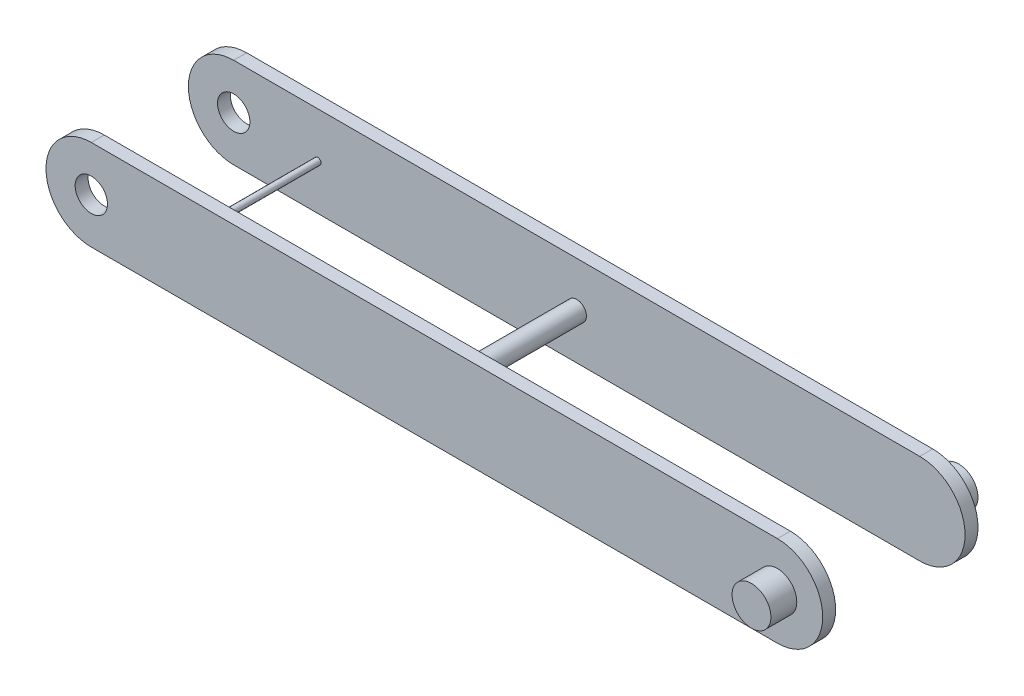
ISO-10303-21;
HEADER;
FILE_DESCRIPTION(('STEP AP214'),'2;1');
FILE_NAME('part.step','',(''),(''),'','','');
FILE_SCHEMA(('AUTOMOTIVE_DESIGN { 1 0 10303 214 1 1 1 1 }'));
ENDSEC;
DATA;
#1=APPLICATION_CONTEXT('core data for automotive mechanical design processes');
#2=APPLICATION_PROTOCOL_DEFINITION('international standard','automotive_design',2000,#1);
#3=PRODUCT_CONTEXT('',#1,'mechanical');
#4=PRODUCT('Part','Part','',(#3));
#5=PRODUCT_RELATED_PRODUCT_CATEGORY('part','',(#4));
#6=PRODUCT_DEFINITION_FORMATION('','',#4);
#7=PRODUCT_DEFINITION_CONTEXT('part definition',#1,'design');
#8=PRODUCT_DEFINITION('design','',#6,#7);
#9=PRODUCT_DEFINITION_SHAPE('','',#8);
#10=(LENGTH_UNIT() NAMED_UNIT(*) SI_UNIT(.MILLI.,.METRE.));
#11=(NAMED_UNIT(*) PLANE_ANGLE_UNIT() SI_UNIT($,.RADIAN.));
#12=(NAMED_UNIT(*) SI_UNIT($,.STERADIAN.) SOLID_ANGLE_UNIT());
#13=UNCERTAINTY_MEASURE_WITH_UNIT(LENGTH_MEASURE(1.E-05),#10,'distance_accuracy_value','');
#14=(GEOMETRIC_REPRESENTATION_CONTEXT(3) GLOBAL_UNCERTAINTY_ASSIGNED_CONTEXT((#13)) GLOBAL_UNIT_ASSIGNED_CONTEXT((#10,
#11,#12)) REPRESENTATION_CONTEXT('',''));
#15=CARTESIAN_POINT('',(0.,0.,0.));
#16=DIRECTION('',(0.,0.,1.));
#17=DIRECTION('',(1.,0.,0.));
#18=AXIS2_PLACEMENT_3D('',#15,#16,#17);
#19=CARTESIAN_POINT('',(-265.,0.,10.));
#20=DIRECTION('',(0.,0.,-1.));
#21=DIRECTION('',(-1.,0.,0.));
#22=AXIS2_PLACEMENT_3D('',#19,#20,#21);
#23=CYLINDRICAL_SURFACE('',#22,35.0000000000001);
#24=CARTESIAN_POINT('',(-265.,0.,0.));
#25=DIRECTION('',(0.,0.,1.));
#26=DIRECTION('',(1.,0.,0.));
#27=AXIS2_PLACEMENT_3D('',#24,#25,#26);
#28=CIRCLE('',#27,35.0000000000001);
#29=CARTESIAN_POINT('',(-265.,35.0000000000001,0.));
#30=VERTEX_POINT('',#29);
#31=CARTESIAN_POINT('',(-265.,-35.0000000000001,0.));
#32=VERTEX_POINT('',#31);
#33=EDGE_CURVE('E163',#30,#32,#28,.T.);
#34=ORIENTED_EDGE('',*,*,#33,.T.);
#35=DIRECTION('',(0.,0.,-1.));
#36=VECTOR('',#35,1.);
#37=CARTESIAN_POINT('',(-265.,-35.0000000000001,10.));
#38=LINE('',#37,#36);
#39=CARTESIAN_POINT('',(-265.,-35.0000000000001,10.));
#40=VERTEX_POINT('',#39);
#41=EDGE_CURVE('E175',#40,#32,#38,.T.);
#42=ORIENTED_EDGE('',*,*,#41,.F.);
#43=CARTESIAN_POINT('',(-265.,0.,10.));
#44=DIRECTION('',(0.,0.,1.));
#45=DIRECTION('',(1.,0.,0.));
#46=AXIS2_PLACEMENT_3D('',#43,#44,#45);
#47=CIRCLE('',#46,35.0000000000001);
#48=CARTESIAN_POINT('',(-265.,35.0000000000001,10.));
#49=VERTEX_POINT('',#48);
#50=EDGE_CURVE('E156',#49,#40,#47,.T.);
#51=ORIENTED_EDGE('',*,*,#50,.F.);
#52=DIRECTION('',(0.,0.,-1.));
#53=VECTOR('',#52,1.);
#54=CARTESIAN_POINT('',(-265.,35.0000000000001,10.));
#55=LINE('',#54,#53);
#56=EDGE_CURVE('E162',#49,#30,#55,.T.);
#57=ORIENTED_EDGE('',*,*,#56,.T.);
#58=EDGE_LOOP('',(#34,#42,#51,#57));
#59=FACE_BOUND('',#58,.T.);
#60=ADVANCED_FACE('F35',(#59),#23,.T.);
#61=CARTESIAN_POINT('',(-265.,-35.0000000000001,10.));
#62=DIRECTION('',(0.,1.,0.));
#63=DIRECTION('',(0.,0.,1.));
#64=AXIS2_PLACEMENT_3D('',#61,#62,#63);
#65=PLANE('',#64);
#66=DIRECTION('',(1.,0.,0.));
#67=VECTOR('',#66,1.);
#68=CARTESIAN_POINT('',(-265.,-35.0000000000001,0.));
#69=LINE('',#68,#67);
#70=CARTESIAN_POINT('',(265.,-35.,0.));
#71=VERTEX_POINT('',#70);
#72=EDGE_CURVE('E166',#32,#71,#69,.T.);
#73=ORIENTED_EDGE('',*,*,#72,.T.);
#74=DIRECTION('',(0.,0.,-1.));
#75=VECTOR('',#74,1.);
#76=CARTESIAN_POINT('',(265.,-35.,10.));
#77=LINE('',#76,#75);
#78=CARTESIAN_POINT('',(265.,-35.,10.));
#79=VERTEX_POINT('',#78);
#80=EDGE_CURVE('E173',#79,#71,#77,.T.);
#81=ORIENTED_EDGE('',*,*,#80,.F.);
#82=DIRECTION('',(1.,0.,0.));
#83=VECTOR('',#82,1.);
#84=CARTESIAN_POINT('',(-265.,-35.0000000000001,10.));
#85=LINE('',#84,#83);
#86=EDGE_CURVE('E84',#40,#79,#85,.T.);
#87=ORIENTED_EDGE('',*,*,#86,.F.);
#88=ORIENTED_EDGE('',*,*,#41,.T.);
#89=EDGE_LOOP('',(#73,#81,#87,#88));
#90=FACE_BOUND('',#89,.T.);
#91=ADVANCED_FACE('F199',(#90),#65,.F.);
#92=CARTESIAN_POINT('',(265.,0.,10.));
#93=DIRECTION('',(0.,0.,-1.));
#94=DIRECTION('',(-1.,0.,0.));
#95=AXIS2_PLACEMENT_3D('',#92,#93,#94);
#96=CYLINDRICAL_SURFACE('',#95,35.0000000000001);
#97=CARTESIAN_POINT('',(265.,0.,0.));
#98=DIRECTION('',(0.,0.,1.));
#99=DIRECTION('',(1.,0.,0.));
#100=AXIS2_PLACEMENT_3D('',#97,#98,#99);
#101=CIRCLE('',#100,35.0000000000001);
#102=CARTESIAN_POINT('',(265.,35.0000000000001,0.));
#103=VERTEX_POINT('',#102);
#104=EDGE_CURVE('E70',#71,#103,#101,.T.);
#105=ORIENTED_EDGE('',*,*,#104,.T.);
#106=DIRECTION('',(0.,0.,-1.));
#107=VECTOR('',#106,1.);
#108=CARTESIAN_POINT('',(265.,35.0000000000001,10.));
#109=LINE('',#108,#107);
#110=CARTESIAN_POINT('',(265.,35.0000000000001,10.));
#111=VERTEX_POINT('',#110);
#112=EDGE_CURVE('E171',#111,#103,#109,.T.);
#113=ORIENTED_EDGE('',*,*,#112,.F.);
#114=CARTESIAN_POINT('',(265.,0.,10.));
#115=DIRECTION('',(0.,0.,1.));
#116=DIRECTION('',(1.,0.,0.));
#117=AXIS2_PLACEMENT_3D('',#114,#115,#116);
#118=CIRCLE('',#117,35.0000000000001);
#119=EDGE_CURVE('E159',#79,#111,#118,.T.);
#120=ORIENTED_EDGE('',*,*,#119,.F.);
#121=ORIENTED_EDGE('',*,*,#80,.T.);
#122=EDGE_LOOP('',(#105,#113,#120,#121));
#123=FACE_BOUND('',#122,.T.);
#124=ADVANCED_FACE('F204',(#123),#96,.T.);
#125=CARTESIAN_POINT('',(-265.,35.0000000000001,10.));
#126=DIRECTION('',(0.,-1.,0.));
#127=DIRECTION('',(0.,0.,-1.));
#128=AXIS2_PLACEMENT_3D('',#125,#126,#127);
#129=PLANE('',#128);
#130=DIRECTION('',(-1.,0.,0.));
#131=VECTOR('',#130,1.);
#132=CARTESIAN_POINT('',(-265.,35.0000000000001,0.));
#133=LINE('',#132,#131);
#134=EDGE_CURVE('E76',#103,#30,#133,.T.);
#135=ORIENTED_EDGE('',*,*,#134,.T.);
#136=ORIENTED_EDGE('',*,*,#56,.F.);
#137=DIRECTION('',(-1.,0.,0.));
#138=VECTOR('',#137,1.);
#139=CARTESIAN_POINT('',(-265.,35.0000000000001,10.));
#140=LINE('',#139,#138);
#141=EDGE_CURVE('E52',#111,#49,#140,.T.);
#142=ORIENTED_EDGE('',*,*,#141,.F.);
#143=ORIENTED_EDGE('',*,*,#112,.T.);
#144=EDGE_LOOP('',(#135,#136,#142,#143));
#145=FACE_BOUND('',#144,.T.);
#146=ADVANCED_FACE('F210',(#145),#129,.F.);
#147=CARTESIAN_POINT('',(-265.,0.,10.));
#148=DIRECTION('',(0.,0.,1.));
#149=DIRECTION('',(1.,0.,0.));
#150=AXIS2_PLACEMENT_3D('',#147,#148,#149);
#151=PLANE('',#150);
#152=CARTESIAN_POINT('',(265.,0.,10.));
#153=DIRECTION('',(0.,0.,1.));
#154=DIRECTION('',(1.,0.,0.));
#155=AXIS2_PLACEMENT_3D('',#152,#153,#154);
#156=CIRCLE('',#155,15.);
#157=CARTESIAN_POINT('',(280.,0.,10.));
#158=VERTEX_POINT('',#157);
#159=EDGE_CURVE('E376',#158,#158,#156,.T.);
#160=ORIENTED_EDGE('',*,*,#159,.F.);
#161=EDGE_LOOP('',(#160));
#162=FACE_BOUND('',#161,.T.);
#163=CARTESIAN_POINT('',(-265.,0.,10.));
#164=DIRECTION('',(0.,0.,1.));
#165=DIRECTION('',(1.,0.,0.));
#166=AXIS2_PLACEMENT_3D('',#163,#164,#165);
#167=CIRCLE('',#166,12.5);
#168=CARTESIAN_POINT('',(-252.5,0.,10.));
#169=VERTEX_POINT('',#168);
#170=EDGE_CURVE('E396',#169,#169,#167,.T.);
#171=ORIENTED_EDGE('',*,*,#170,.F.);
#172=EDGE_LOOP('',(#171));
#173=FACE_BOUND('',#172,.T.);
#174=ORIENTED_EDGE('',*,*,#50,.T.);
#175=ORIENTED_EDGE('',*,*,#86,.T.);
#176=ORIENTED_EDGE('',*,*,#119,.T.);
#177=ORIENTED_EDGE('',*,*,#141,.T.);
#178=EDGE_LOOP('',(#174,#175,#176,#177));
#179=FACE_BOUND('',#178,.T.);
#180=ADVANCED_FACE('F192',(#162,#173,#179),#151,.T.);
#181=CARTESIAN_POINT('',(-265.,0.,0.));
#182=DIRECTION('',(0.,0.,1.));
#183=DIRECTION('',(1.,0.,0.));
#184=AXIS2_PLACEMENT_3D('',#181,#182,#183);
#185=PLANE('',#184);
#186=CARTESIAN_POINT('',(-265.,0.,0.));
#187=DIRECTION('',(0.,0.,1.));
#188=DIRECTION('',(1.,0.,0.));
#189=AXIS2_PLACEMENT_3D('',#186,#187,#188);
#190=CIRCLE('',#189,12.5);
#191=CARTESIAN_POINT('',(-252.5,0.,0.));
#192=VERTEX_POINT('',#191);
#193=EDGE_CURVE('E393',#192,#192,#190,.T.);
#194=ORIENTED_EDGE('',*,*,#193,.T.);
#195=EDGE_LOOP('',(#194));
#196=FACE_BOUND('',#195,.T.);
#197=CARTESIAN_POINT('',(-200.,0.,0.));
#198=DIRECTION('',(0.,0.,1.));
#199=DIRECTION('',(1.,0.,0.));
#200=AXIS2_PLACEMENT_3D('',#197,#198,#199);
#201=CIRCLE('',#200,2.5);
#202=CARTESIAN_POINT('',(-197.5,0.,0.));
#203=VERTEX_POINT('',#202);
#204=EDGE_CURVE('E142',#203,#203,#201,.T.);
#205=ORIENTED_EDGE('',*,*,#204,.T.);
#206=EDGE_LOOP('',(#205));
#207=FACE_BOUND('',#206,.T.);
#208=CARTESIAN_POINT('',(0.,0.,0.));
#209=DIRECTION('',(0.,0.,1.));
#210=DIRECTION('',(1.,0.,0.));
#211=AXIS2_PLACEMENT_3D('',#208,#209,#210);
#212=CIRCLE('',#211,7.5);
#213=CARTESIAN_POINT('',(7.5,0.,0.));
#214=VERTEX_POINT('',#213);
#215=EDGE_CURVE('E152',#214,#214,#212,.T.);
#216=ORIENTED_EDGE('',*,*,#215,.T.);
#217=EDGE_LOOP('',(#216));
#218=FACE_BOUND('',#217,.T.);
#219=ORIENTED_EDGE('',*,*,#33,.F.);
#220=ORIENTED_EDGE('',*,*,#134,.F.);
#221=ORIENTED_EDGE('',*,*,#104,.F.);
#222=ORIENTED_EDGE('',*,*,#72,.F.);
#223=EDGE_LOOP('',(#219,#220,#221,#222));
#224=FACE_BOUND('',#223,.T.);
#225=ADVANCED_FACE('F179',(#196,#207,#218,#224),#185,.F.);
#226=CARTESIAN_POINT('',(0.,0.,35.));
#227=DIRECTION('',(0.,0.,-1.));
#228=DIRECTION('',(-1.,0.,0.));
#229=AXIS2_PLACEMENT_3D('',#226,#227,#228);
#230=CYLINDRICAL_SURFACE('',#229,7.5);
#231=CARTESIAN_POINT('',(0.,0.,-100.));
#232=DIRECTION('',(0.,0.,1.));
#233=DIRECTION('',(1.,0.,0.));
#234=AXIS2_PLACEMENT_3D('',#231,#232,#233);
#235=CIRCLE('',#234,7.5);
#236=CARTESIAN_POINT('',(7.5,0.,-100.));
#237=VERTEX_POINT('',#236);
#238=EDGE_CURVE('E38',#237,#237,#235,.F.);
#239=ORIENTED_EDGE('',*,*,#238,.F.);
#240=EDGE_LOOP('',(#239));
#241=FACE_BOUND('',#240,.T.);
#242=ORIENTED_EDGE('',*,*,#215,.F.);
#243=EDGE_LOOP('',(#242));
#244=FACE_BOUND('',#243,.T.);
#245=ADVANCED_FACE('F182',(#241,#244),#230,.T.);
#246=CARTESIAN_POINT('',(-265.,0.,-110.));
#247=DIRECTION('',(0.,0.,1.));
#248=DIRECTION('',(1.,0.,0.));
#249=AXIS2_PLACEMENT_3D('',#246,#247,#248);
#250=CYLINDRICAL_SURFACE('',#249,34.9999999999999);
#251=CARTESIAN_POINT('',(-265.,0.,-100.));
#252=DIRECTION('',(0.,0.,1.));
#253=DIRECTION('',(1.,0.,0.));
#254=AXIS2_PLACEMENT_3D('',#251,#252,#253);
#255=CIRCLE('',#254,34.9999999999999);
#256=CARTESIAN_POINT('',(-265.,34.9999999999999,-100.));
#257=VERTEX_POINT('',#256);
#258=CARTESIAN_POINT('',(-265.,-34.9999999999999,-100.));
#259=VERTEX_POINT('',#258);
#260=EDGE_CURVE('E146',#257,#259,#255,.T.);
#261=ORIENTED_EDGE('',*,*,#260,.F.);
#262=DIRECTION('',(0.,0.,1.));
#263=VECTOR('',#262,1.);
#264=CARTESIAN_POINT('',(-265.,34.9999999999999,-110.));
#265=LINE('',#264,#263);
#266=CARTESIAN_POINT('',(-265.,34.9999999999999,-110.));
#267=VERTEX_POINT('',#266);
#268=EDGE_CURVE('E135',#267,#257,#265,.T.);
#269=ORIENTED_EDGE('',*,*,#268,.F.);
#270=CARTESIAN_POINT('',(-265.,0.,-110.));
#271=DIRECTION('',(0.,0.,1.));
#272=DIRECTION('',(1.,0.,0.));
#273=AXIS2_PLACEMENT_3D('',#270,#271,#272);
#274=CIRCLE('',#273,34.9999999999999);
#275=CARTESIAN_POINT('',(-265.,-34.9999999999999,-110.));
#276=VERTEX_POINT('',#275);
#277=EDGE_CURVE('E129',#267,#276,#274,.T.);
#278=ORIENTED_EDGE('',*,*,#277,.T.);
#279=DIRECTION('',(0.,0.,1.));
#280=VECTOR('',#279,1.);
#281=CARTESIAN_POINT('',(-265.,-34.9999999999999,-110.));
#282=LINE('',#281,#280);
#283=EDGE_CURVE('E111',#276,#259,#282,.T.);
#284=ORIENTED_EDGE('',*,*,#283,.T.);
#285=EDGE_LOOP('',(#261,#269,#278,#284));
#286=FACE_BOUND('',#285,.T.);
#287=ADVANCED_FACE('F134',(#286),#250,.T.);
#288=CARTESIAN_POINT('',(-265.,34.9999999999999,-110.));
#289=DIRECTION('',(0.,1.,0.));
#290=DIRECTION('',(-1.,0.,0.));
#291=AXIS2_PLACEMENT_3D('',#288,#289,#290);
#292=PLANE('',#291);
#293=DIRECTION('',(-1.,0.,0.));
#294=VECTOR('',#293,1.);
#295=CARTESIAN_POINT('',(-265.,34.9999999999999,-100.));
#296=LINE('',#295,#294);
#297=CARTESIAN_POINT('',(265.,35.,-100.));
#298=VERTEX_POINT('',#297);
#299=EDGE_CURVE('E136',#298,#257,#296,.T.);
#300=ORIENTED_EDGE('',*,*,#299,.F.);
#301=DIRECTION('',(0.,0.,1.));
#302=VECTOR('',#301,1.);
#303=CARTESIAN_POINT('',(265.,35.,-110.));
#304=LINE('',#303,#302);
#305=CARTESIAN_POINT('',(265.,35.,-110.));
#306=VERTEX_POINT('',#305);
#307=EDGE_CURVE('E153',#306,#298,#304,.T.);
#308=ORIENTED_EDGE('',*,*,#307,.F.);
#309=DIRECTION('',(-1.,0.,0.));
#310=VECTOR('',#309,1.);
#311=CARTESIAN_POINT('',(-265.,34.9999999999999,-110.));
#312=LINE('',#311,#310);
#313=EDGE_CURVE('E122',#306,#267,#312,.T.);
#314=ORIENTED_EDGE('',*,*,#313,.T.);
#315=ORIENTED_EDGE('',*,*,#268,.T.);
#316=EDGE_LOOP('',(#300,#308,#314,#315));
#317=FACE_BOUND('',#316,.T.);
#318=ADVANCED_FACE('F190',(#317),#292,.T.);
#319=CARTESIAN_POINT('',(265.,0.,-110.));
#320=DIRECTION('',(0.,0.,1.));
#321=DIRECTION('',(1.,0.,0.));
#322=AXIS2_PLACEMENT_3D('',#319,#320,#321);
#323=CYLINDRICAL_SURFACE('',#322,34.9999999999999);
#324=CARTESIAN_POINT('',(265.,0.,-100.));
#325=DIRECTION('',(0.,0.,1.));
#326=DIRECTION('',(1.,0.,0.));
#327=AXIS2_PLACEMENT_3D('',#324,#325,#326);
#328=CIRCLE('',#327,34.9999999999999);
#329=CARTESIAN_POINT('',(265.,-34.9999999999999,-100.));
#330=VERTEX_POINT('',#329);
#331=EDGE_CURVE('E139',#330,#298,#328,.T.);
#332=ORIENTED_EDGE('',*,*,#331,.F.);
#333=DIRECTION('',(0.,0.,1.));
#334=VECTOR('',#333,1.);
#335=CARTESIAN_POINT('',(265.,-34.9999999999999,-110.));
#336=LINE('',#335,#334);
#337=CARTESIAN_POINT('',(265.,-34.9999999999999,-110.));
#338=VERTEX_POINT('',#337);
#339=EDGE_CURVE('E121',#338,#330,#336,.T.);
#340=ORIENTED_EDGE('',*,*,#339,.F.);
#341=CARTESIAN_POINT('',(265.,0.,-110.));
#342=DIRECTION('',(0.,0.,1.));
#343=DIRECTION('',(1.,0.,0.));
#344=AXIS2_PLACEMENT_3D('',#341,#342,#343);
#345=CIRCLE('',#344,34.9999999999999);
#346=EDGE_CURVE('E132',#338,#306,#345,.T.);
#347=ORIENTED_EDGE('',*,*,#346,.T.);
#348=ORIENTED_EDGE('',*,*,#307,.T.);
#349=EDGE_LOOP('',(#332,#340,#347,#348));
#350=FACE_BOUND('',#349,.T.);
#351=ADVANCED_FACE('F251',(#350),#323,.T.);
#352=CARTESIAN_POINT('',(-265.,-34.9999999999999,-110.));
#353=DIRECTION('',(0.,-1.,0.));
#354=DIRECTION('',(1.,0.,0.));
#355=AXIS2_PLACEMENT_3D('',#352,#353,#354);
#356=PLANE('',#355);
#357=DIRECTION('',(1.,0.,0.));
#358=VECTOR('',#357,1.);
#359=CARTESIAN_POINT('',(-265.,-34.9999999999999,-100.));
#360=LINE('',#359,#358);
#361=EDGE_CURVE('E116',#259,#330,#360,.T.);
#362=ORIENTED_EDGE('',*,*,#361,.F.);
#363=ORIENTED_EDGE('',*,*,#283,.F.);
#364=DIRECTION('',(1.,0.,0.));
#365=VECTOR('',#364,1.);
#366=CARTESIAN_POINT('',(-265.,-34.9999999999999,-110.));
#367=LINE('',#366,#365);
#368=EDGE_CURVE('E114',#276,#338,#367,.T.);
#369=ORIENTED_EDGE('',*,*,#368,.T.);
#370=ORIENTED_EDGE('',*,*,#339,.T.);
#371=EDGE_LOOP('',(#362,#363,#369,#370));
#372=FACE_BOUND('',#371,.T.);
#373=ADVANCED_FACE('F113',(#372),#356,.T.);
#374=CARTESIAN_POINT('',(-265.,0.,-100.));
#375=DIRECTION('',(0.,0.,1.));
#376=DIRECTION('',(1.,0.,0.));
#377=AXIS2_PLACEMENT_3D('',#374,#375,#376);
#378=PLANE('',#377);
#379=CARTESIAN_POINT('',(-265.,0.,-100.));
#380=DIRECTION('',(0.,0.,1.));
#381=DIRECTION('',(1.,0.,0.));
#382=AXIS2_PLACEMENT_3D('',#379,#380,#381);
#383=CIRCLE('',#382,12.5);
#384=CARTESIAN_POINT('',(-252.5,0.,-100.));
#385=VERTEX_POINT('',#384);
#386=EDGE_CURVE('E390',#385,#385,#383,.T.);
#387=ORIENTED_EDGE('',*,*,#386,.F.);
#388=EDGE_LOOP('',(#387));
#389=FACE_BOUND('',#388,.T.);
#390=CARTESIAN_POINT('',(-200.,0.,-100.));
#391=DIRECTION('',(0.,0.,1.));
#392=DIRECTION('',(1.,0.,0.));
#393=AXIS2_PLACEMENT_3D('',#390,#391,#392);
#394=CIRCLE('',#393,2.5);
#395=CARTESIAN_POINT('',(-197.5,0.,-100.));
#396=VERTEX_POINT('',#395);
#397=EDGE_CURVE('E11',#396,#396,#394,.T.);
#398=ORIENTED_EDGE('',*,*,#397,.F.);
#399=EDGE_LOOP('',(#398));
#400=FACE_BOUND('',#399,.T.);
#401=ORIENTED_EDGE('',*,*,#238,.T.);
#402=EDGE_LOOP('',(#401));
#403=FACE_BOUND('',#402,.T.);
#404=ORIENTED_EDGE('',*,*,#260,.T.);
#405=ORIENTED_EDGE('',*,*,#361,.T.);
#406=ORIENTED_EDGE('',*,*,#331,.T.);
#407=ORIENTED_EDGE('',*,*,#299,.T.);
#408=EDGE_LOOP('',(#404,#405,#406,#407));
#409=FACE_BOUND('',#408,.T.);
#410=ADVANCED_FACE('F270',(#389,#400,#403,#409),#378,.T.);
#411=CARTESIAN_POINT('',(0.,0.,-110.));
#412=DIRECTION('',(0.,0.,-1.));
#413=DIRECTION('',(-1.,0.,0.));
#414=AXIS2_PLACEMENT_3D('',#411,#412,#413);
#415=PLANE('',#414);
#416=CARTESIAN_POINT('',(265.,0.,-110.));
#417=DIRECTION('',(0.,0.,-1.));
#418=DIRECTION('',(-1.,0.,0.));
#419=AXIS2_PLACEMENT_3D('',#416,#417,#418);
#420=CIRCLE('',#419,15.);
#421=CARTESIAN_POINT('',(250.,0.,-110.));
#422=VERTEX_POINT('',#421);
#423=EDGE_CURVE('E377',#422,#422,#420,.T.);
#424=ORIENTED_EDGE('',*,*,#423,.F.);
#425=EDGE_LOOP('',(#424));
#426=FACE_BOUND('',#425,.T.);
#427=CARTESIAN_POINT('',(-265.,0.,-110.));
#428=DIRECTION('',(0.,0.,-1.));
#429=DIRECTION('',(-1.,0.,0.));
#430=AXIS2_PLACEMENT_3D('',#427,#428,#429);
#431=CIRCLE('',#430,12.5);
#432=CARTESIAN_POINT('',(-277.5,0.,-110.));
#433=VERTEX_POINT('',#432);
#434=EDGE_CURVE('E386',#433,#433,#431,.T.);
#435=ORIENTED_EDGE('',*,*,#434,.F.);
#436=EDGE_LOOP('',(#435));
#437=FACE_BOUND('',#436,.T.);
#438=ORIENTED_EDGE('',*,*,#277,.F.);
#439=ORIENTED_EDGE('',*,*,#313,.F.);
#440=ORIENTED_EDGE('',*,*,#346,.F.);
#441=ORIENTED_EDGE('',*,*,#368,.F.);
#442=EDGE_LOOP('',(#438,#439,#440,#441));
#443=FACE_BOUND('',#442,.T.);
#444=ADVANCED_FACE('F127',(#426,#437,#443),#415,.T.);
#445=CARTESIAN_POINT('',(-200.,0.,35.));
#446=DIRECTION('',(0.,0.,-1.));
#447=DIRECTION('',(-1.,0.,0.));
#448=AXIS2_PLACEMENT_3D('',#445,#446,#447);
#449=CYLINDRICAL_SURFACE('',#448,2.5);
#450=ORIENTED_EDGE('',*,*,#397,.T.);
#451=EDGE_LOOP('',(#450));
#452=FACE_BOUND('',#451,.T.);
#453=ORIENTED_EDGE('',*,*,#204,.F.);
#454=EDGE_LOOP('',(#453));
#455=FACE_BOUND('',#454,.T.);
#456=ADVANCED_FACE('F277',(#452,#455),#449,.T.);
#457=CARTESIAN_POINT('',(-265.,0.,55.));
#458=DIRECTION('',(0.,0.,-1.));
#459=DIRECTION('',(-1.,0.,0.));
#460=AXIS2_PLACEMENT_3D('',#457,#458,#459);
#461=CYLINDRICAL_SURFACE('',#460,12.5);
#462=ORIENTED_EDGE('',*,*,#386,.T.);
#463=EDGE_LOOP('',(#462));
#464=FACE_BOUND('',#463,.T.);
#465=ORIENTED_EDGE('',*,*,#434,.T.);
#466=EDGE_LOOP('',(#465));
#467=FACE_BOUND('',#466,.T.);
#468=ADVANCED_FACE('F282',(#464,#467),#461,.F.);
#469=ORIENTED_EDGE('',*,*,#170,.T.);
#470=EDGE_LOOP('',(#469));
#471=FACE_BOUND('',#470,.T.);
#472=ORIENTED_EDGE('',*,*,#193,.F.);
#473=EDGE_LOOP('',(#472));
#474=FACE_BOUND('',#473,.T.);
#475=ADVANCED_FACE('F305',(#471,#474),#461,.F.);
#476=CARTESIAN_POINT('',(265.,0.,30.));
#477=DIRECTION('',(0.,0.,-1.));
#478=DIRECTION('',(-1.,0.,0.));
#479=AXIS2_PLACEMENT_3D('',#476,#477,#478);
#480=CYLINDRICAL_SURFACE('',#479,15.);
#481=CARTESIAN_POINT('',(265.,0.,30.));
#482=DIRECTION('',(0.,0.,1.));
#483=DIRECTION('',(1.,0.,0.));
#484=AXIS2_PLACEMENT_3D('',#481,#482,#483);
#485=CIRCLE('',#484,15.);
#486=CARTESIAN_POINT('',(280.,0.,30.));
#487=VERTEX_POINT('',#486);
#488=EDGE_CURVE('E380',#487,#487,#485,.T.);
#489=ORIENTED_EDGE('',*,*,#488,.F.);
#490=EDGE_LOOP('',(#489));
#491=FACE_BOUND('',#490,.T.);
#492=ORIENTED_EDGE('',*,*,#159,.T.);
#493=EDGE_LOOP('',(#492));
#494=FACE_BOUND('',#493,.T.);
#495=ADVANCED_FACE('F315',(#491,#494),#480,.T.);
#496=CARTESIAN_POINT('',(265.,0.,30.));
#497=DIRECTION('',(0.,0.,1.));
#498=DIRECTION('',(1.,0.,0.));
#499=AXIS2_PLACEMENT_3D('',#496,#497,#498);
#500=PLANE('',#499);
#501=ORIENTED_EDGE('',*,*,#488,.T.);
#502=EDGE_LOOP('',(#501));
#503=FACE_BOUND('',#502,.T.);
#504=ADVANCED_FACE('F325',(#503),#500,.T.);
#505=CARTESIAN_POINT('',(265.,0.,-130.));
#506=DIRECTION('',(0.,0.,1.));
#507=DIRECTION('',(1.,0.,0.));
#508=AXIS2_PLACEMENT_3D('',#505,#506,#507);
#509=CYLINDRICAL_SURFACE('',#508,15.);
#510=CARTESIAN_POINT('',(265.,0.,-130.));
#511=DIRECTION('',(0.,0.,-1.));
#512=DIRECTION('',(-1.,0.,0.));
#513=AXIS2_PLACEMENT_3D('',#510,#511,#512);
#514=CIRCLE('',#513,15.);
#515=CARTESIAN_POINT('',(250.,0.,-130.));
#516=VERTEX_POINT('',#515);
#517=EDGE_CURVE('E375',#516,#516,#514,.T.);
#518=ORIENTED_EDGE('',*,*,#517,.F.);
#519=EDGE_LOOP('',(#518));
#520=FACE_BOUND('',#519,.T.);
#521=ORIENTED_EDGE('',*,*,#423,.T.);
#522=EDGE_LOOP('',(#521));
#523=FACE_BOUND('',#522,.T.);
#524=ADVANCED_FACE('F335',(#520,#523),#509,.T.);
#525=CARTESIAN_POINT('',(265.,0.,-130.));
#526=DIRECTION('',(0.,0.,-1.));
#527=DIRECTION('',(-1.,0.,0.));
#528=AXIS2_PLACEMENT_3D('',#525,#526,#527);
#529=PLANE('',#528);
#530=ORIENTED_EDGE('',*,*,#517,.T.);
#531=EDGE_LOOP('',(#530));
#532=FACE_BOUND('',#531,.T.);
#533=ADVANCED_FACE('F351',(#532),#529,.T.);
#534=CLOSED_SHELL('',(#60,#91,#124,#146,#180,#225,#245,#287,#318,#351,#373,#410,#444,#456,#468,
#475,#495,#504,#524,#533));
#535=MANIFOLD_SOLID_BREP('B2',#534);
#536=ADVANCED_BREP_SHAPE_REPRESENTATION('',(#18,#535),#14);
#537=SHAPE_DEFINITION_REPRESENTATION(#9,#536);
ENDSEC;
END-ISO-10303-21;
